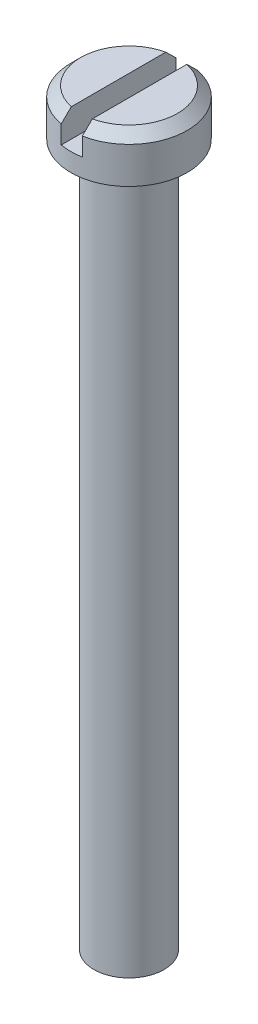
ISO-10303-21;
HEADER;
FILE_DESCRIPTION(('STEP AP214'),'2;1');
FILE_NAME('part.step','',(''),(''),'','','');
FILE_SCHEMA(('AUTOMOTIVE_DESIGN { 1 0 10303 214 1 1 1 1 }'));
ENDSEC;
DATA;
#1=APPLICATION_CONTEXT('core data for automotive mechanical design processes');
#2=APPLICATION_PROTOCOL_DEFINITION('international standard','automotive_design',2000,#1);
#3=PRODUCT_CONTEXT('',#1,'mechanical');
#4=PRODUCT('Part','Part','',(#3));
#5=PRODUCT_RELATED_PRODUCT_CATEGORY('part','',(#4));
#6=PRODUCT_DEFINITION_FORMATION('','',#4);
#7=PRODUCT_DEFINITION_CONTEXT('part definition',#1,'design');
#8=PRODUCT_DEFINITION('design','',#6,#7);
#9=PRODUCT_DEFINITION_SHAPE('','',#8);
#10=(LENGTH_UNIT() NAMED_UNIT(*) SI_UNIT(.MILLI.,.METRE.));
#11=(NAMED_UNIT(*) PLANE_ANGLE_UNIT() SI_UNIT($,.RADIAN.));
#12=(NAMED_UNIT(*) SI_UNIT($,.STERADIAN.) SOLID_ANGLE_UNIT());
#13=UNCERTAINTY_MEASURE_WITH_UNIT(LENGTH_MEASURE(1.E-05),#10,'distance_accuracy_value','');
#14=(GEOMETRIC_REPRESENTATION_CONTEXT(3) GLOBAL_UNCERTAINTY_ASSIGNED_CONTEXT((#13)) GLOBAL_UNIT_ASSIGNED_CONTEXT((#10,
#11,#12)) REPRESENTATION_CONTEXT('',''));
#15=CARTESIAN_POINT('',(0.,0.,0.));
#16=DIRECTION('',(0.,0.,1.));
#17=DIRECTION('',(1.,0.,0.));
#18=AXIS2_PLACEMENT_3D('',#15,#16,#17);
#19=CARTESIAN_POINT('',(0.,53.3,0.));
#20=DIRECTION('',(0.,1.,0.));
#21=DIRECTION('',(0.,0.,1.));
#22=AXIS2_PLACEMENT_3D('',#19,#20,#21);
#23=PLANE('',#22);
#24=CARTESIAN_POINT('',(0.,53.3,0.));
#25=DIRECTION('',(0.,1.,0.));
#26=DIRECTION('',(0.,0.,1.));
#27=AXIS2_PLACEMENT_3D('',#24,#25,#26);
#28=CIRCLE('',#27,3.44999999999998);
#29=CARTESIAN_POINT('',(-0.746487537225198,53.3,-3.36827201347625));
#30=VERTEX_POINT('',#29);
#31=CARTESIAN_POINT('',(-0.746487537225198,53.3,3.36827201347625));
#32=VERTEX_POINT('',#31);
#33=EDGE_CURVE('E130',#30,#32,#28,.T.);
#34=ORIENTED_EDGE('',*,*,#33,.T.);
#35=DIRECTION('',(0.,0.,-1.));
#36=VECTOR('',#35,1.);
#37=CARTESIAN_POINT('',(-0.746487537225198,53.3,0.));
#38=LINE('',#37,#36);
#39=EDGE_CURVE('E114',#32,#30,#38,.T.);
#40=ORIENTED_EDGE('',*,*,#39,.T.);
#41=EDGE_LOOP('',(#34,#40));
#42=FACE_BOUND('',#41,.T.);
#43=ADVANCED_FACE('F34',(#42),#23,.T.);
#44=CARTESIAN_POINT('',(0.753512462774802,53.3,3.36670743731066));
#45=VERTEX_POINT('',#44);
#46=CARTESIAN_POINT('',(0.753512462774802,53.3,-3.36670743731066));
#47=VERTEX_POINT('',#46);
#48=EDGE_CURVE('E131',#45,#47,#28,.T.);
#49=ORIENTED_EDGE('',*,*,#48,.T.);
#50=DIRECTION('',(0.,0.,1.));
#51=VECTOR('',#50,1.);
#52=CARTESIAN_POINT('',(0.753512462774802,53.3,0.));
#53=LINE('',#52,#51);
#54=EDGE_CURVE('E104',#47,#45,#53,.T.);
#55=ORIENTED_EDGE('',*,*,#54,.T.);
#56=EDGE_LOOP('',(#49,#55));
#57=FACE_BOUND('',#56,.T.);
#58=ADVANCED_FACE('F164',(#57),#23,.T.);
#59=CARTESIAN_POINT('',(0.,0.,0.));
#60=DIRECTION('',(0.,-1.,0.));
#61=DIRECTION('',(0.,0.,-1.));
#62=AXIS2_PLACEMENT_3D('',#59,#60,#61);
#63=CYLINDRICAL_SURFACE('',#62,4.15);
#64=CARTESIAN_POINT('',(0.,50.,0.));
#65=DIRECTION('',(0.,-1.,0.));
#66=DIRECTION('',(0.,0.,-1.));
#67=AXIS2_PLACEMENT_3D('',#64,#65,#66);
#68=CIRCLE('',#67,4.15);
#69=CARTESIAN_POINT('',(0.,50.,-4.15));
#70=VERTEX_POINT('',#69);
#71=EDGE_CURVE('E125',#70,#70,#68,.T.);
#72=ORIENTED_EDGE('',*,*,#71,.F.);
#73=EDGE_LOOP('',(#72));
#74=FACE_BOUND('',#73,.T.);
#75=CARTESIAN_POINT('',(0.,52.6,0.));
#76=DIRECTION('',(0.,1.,0.));
#77=DIRECTION('',(0.,0.,1.));
#78=AXIS2_PLACEMENT_3D('',#75,#76,#77);
#79=CIRCLE('',#78,4.15);
#80=CARTESIAN_POINT('',(-0.746487537225198,52.6,4.08231017400288));
#81=VERTEX_POINT('',#80);
#82=CARTESIAN_POINT('',(-0.746487537225198,52.6,-4.08231017400288));
#83=VERTEX_POINT('',#82);
#84=EDGE_CURVE('E128',#81,#83,#79,.F.);
#85=ORIENTED_EDGE('',*,*,#84,.T.);
#86=DIRECTION('',(0.,-1.,0.));
#87=VECTOR('',#86,1.);
#88=CARTESIAN_POINT('',(-0.746487537225191,0.,-4.08231017400288));
#89=LINE('',#88,#87);
#90=CARTESIAN_POINT('',(-0.746487537225198,51.3,-4.08231017400288));
#91=VERTEX_POINT('',#90);
#92=EDGE_CURVE('E111',#83,#91,#89,.T.);
#93=ORIENTED_EDGE('',*,*,#92,.T.);
#94=CARTESIAN_POINT('',(0.,51.3,0.));
#95=DIRECTION('',(0.,1.,0.));
#96=DIRECTION('',(0.,0.,1.));
#97=AXIS2_PLACEMENT_3D('',#94,#95,#96);
#98=CIRCLE('',#97,4.15);
#99=CARTESIAN_POINT('',(0.753512462774802,51.3,-4.08101935408826));
#100=VERTEX_POINT('',#99);
#101=EDGE_CURVE('E11',#91,#100,#98,.F.);
#102=ORIENTED_EDGE('',*,*,#101,.T.);
#103=DIRECTION('',(0.,-1.,0.));
#104=VECTOR('',#103,1.);
#105=CARTESIAN_POINT('',(0.753512462774809,0.,-4.08101935408826));
#106=LINE('',#105,#104);
#107=CARTESIAN_POINT('',(0.753512462774802,52.6,-4.08101935408827));
#108=VERTEX_POINT('',#107);
#109=EDGE_CURVE('E97',#100,#108,#106,.F.);
#110=ORIENTED_EDGE('',*,*,#109,.T.);
#111=CARTESIAN_POINT('',(0.753512462774802,52.6,4.08101935408827));
#112=VERTEX_POINT('',#111);
#113=EDGE_CURVE('E103',#108,#112,#79,.F.);
#114=ORIENTED_EDGE('',*,*,#113,.T.);
#115=DIRECTION('',(0.,-1.,0.));
#116=VECTOR('',#115,1.);
#117=CARTESIAN_POINT('',(0.753512462774809,0.,4.08101935408826));
#118=LINE('',#117,#116);
#119=CARTESIAN_POINT('',(0.753512462774802,51.3,4.08101935408826));
#120=VERTEX_POINT('',#119);
#121=EDGE_CURVE('E50',#112,#120,#118,.T.);
#122=ORIENTED_EDGE('',*,*,#121,.T.);
#123=CARTESIAN_POINT('',(-0.746487537225198,51.3,4.08231017400288));
#124=VERTEX_POINT('',#123);
#125=EDGE_CURVE('E39',#120,#124,#98,.F.);
#126=ORIENTED_EDGE('',*,*,#125,.T.);
#127=DIRECTION('',(0.,-1.,0.));
#128=VECTOR('',#127,1.);
#129=CARTESIAN_POINT('',(-0.746487537225191,0.,4.08231017400288));
#130=LINE('',#129,#128);
#131=EDGE_CURVE('E117',#124,#81,#130,.F.);
#132=ORIENTED_EDGE('',*,*,#131,.T.);
#133=EDGE_LOOP('',(#85,#93,#102,#110,#114,#122,#126,#132));
#134=FACE_BOUND('',#133,.T.);
#135=ADVANCED_FACE('F101',(#74,#134),#63,.T.);
#136=CARTESIAN_POINT('',(0.,52.6,0.));
#137=DIRECTION('',(0.,-1.,0.));
#138=DIRECTION('',(0.,0.,-1.));
#139=AXIS2_PLACEMENT_3D('',#136,#137,#138);
#140=CONICAL_SURFACE('',#139,4.15,0.785398163397449);
#141=ORIENTED_EDGE('',*,*,#84,.F.);
#142=CARTESIAN_POINT('',(-0.746487537225197,47.6021205384899,9.11737105744226));
#143=CARTESIAN_POINT('',(-0.746487537225197,47.9259501673613,8.79244813342562));
#144=CARTESIAN_POINT('',(-0.746487537225197,48.2497311398106,8.46747665907128));
#145=CARTESIAN_POINT('',(-0.746487537225197,48.8971444801022,7.81735377987245));
#146=CARTESIAN_POINT('',(-0.746487537225197,49.2207768398204,7.49220236693819));
#147=CARTESIAN_POINT('',(-0.746487537225197,49.8681946117129,6.84128183078387));
#148=CARTESIAN_POINT('',(-0.746487537225197,50.1919797478256,6.51551243290977));
#149=CARTESIAN_POINT('',(-0.746487537225197,50.8391730303335,5.86363036745787));
#150=CARTESIAN_POINT('',(-0.746487537225198,51.1625811940781,5.53751771710753));
#151=CARTESIAN_POINT('',(-0.746487537225198,51.791240444052,4.90244900563556));
#152=CARTESIAN_POINT('',(-0.746487537225198,52.0965228625702,4.59352399148231));
#153=CARTESIAN_POINT('',(-0.746487537225198,52.5537480198971,4.12940385373759));
#154=CARTESIAN_POINT('',(-0.746487537225198,52.7060510235077,3.97456377271986));
#155=CARTESIAN_POINT('',(-0.746487537225198,53.0103115330643,3.66454856299797));
#156=CARTESIAN_POINT('',(-0.746487537225198,53.1622690436871,3.50937343888528));
#157=CARTESIAN_POINT('',(-0.746487537225198,53.4655767529163,3.19864629961184));
#158=CARTESIAN_POINT('',(-0.746487537225198,53.6169273075328,3.04309463243929));
#159=CARTESIAN_POINT('',(-0.746487537225198,53.9188608079756,2.73123206691568));
#160=CARTESIAN_POINT('',(-0.746487537225198,54.0694437129919,2.57492112904512));
#161=CARTESIAN_POINT('',(-0.746487537225198,54.369303846493,2.26112081288205));
#162=CARTESIAN_POINT('',(-0.746487537225198,54.5185813960515,2.1036317431251));
#163=CARTESIAN_POINT('',(-0.746487537225198,54.7406836047217,1.86571517612606));
#164=CARTESIAN_POINT('',(-0.746487537225198,54.8144122619382,1.786132539215));
#165=CARTESIAN_POINT('',(-0.746487537225198,54.9609825348029,1.62615545374431));
#166=CARTESIAN_POINT('',(-0.746487537225198,55.0338241795858,1.54576103200795));
#167=CARTESIAN_POINT('',(-0.746487537225198,55.1261087577991,1.44217959158602));
#168=CARTESIAN_POINT('',(-0.746487537225198,55.1461765874035,1.4195491561738));
#169=CARTESIAN_POINT('',(-0.746487537225198,55.1861903117341,1.37418041000849));
#170=CARTESIAN_POINT('',(-0.746487537225198,55.2061362053838,1.35144209830631));
#171=CARTESIAN_POINT('',(-0.746487537225198,55.265770176061,1.28304126959772));
#172=CARTESIAN_POINT('',(-0.746487537225198,55.305250695493,1.23719716511608));
#173=CARTESIAN_POINT('',(-0.746487537225198,55.3838333063344,1.14445651376992));
#174=CARTESIAN_POINT('',(-0.746487537225198,55.4229285681307,1.0975541634638));
#175=CARTESIAN_POINT('',(-0.746487537225198,55.5000706813637,1.00291204577719));
#176=CARTESIAN_POINT('',(-0.746487537225198,55.5381178142294,0.955172508933252));
#177=CARTESIAN_POINT('',(-0.746487537225198,55.6130993317743,0.858058440836013));
#178=CARTESIAN_POINT('',(-0.746487537225198,55.650018863784,0.808672362573406));
#179=CARTESIAN_POINT('',(-0.746487537225198,55.7216357299789,0.708192697190229));
#180=CARTESIAN_POINT('',(-0.746487537225198,55.7563300558501,0.657096934945558));
#181=CARTESIAN_POINT('',(-0.746487537225198,55.8218218656264,0.553078863339606));
#182=CARTESIAN_POINT('',(-0.746487537225198,55.8526520451017,0.500177497499572));
#183=CARTESIAN_POINT('',(-0.746487537225198,55.908410977991,0.391409437162884));
#184=CARTESIAN_POINT('',(-0.746487537225198,55.9333579857364,0.335552591462451));
#185=CARTESIAN_POINT('',(-0.746487537225198,55.9688266173884,0.233840944381791));
#186=CARTESIAN_POINT('',(-0.746487537225198,55.9813598987131,0.188716700604369));
#187=CARTESIAN_POINT('',(-0.746487537225198,55.9985592117802,0.0970655323430675));
#188=CARTESIAN_POINT('',(-0.746487537225198,56.0032535088329,0.0505442657961943));
#189=CARTESIAN_POINT('',(-0.746487537225198,56.003751003686,-0.0427355921380241));
#190=CARTESIAN_POINT('',(-0.746487537225198,55.999518540233,-0.0894943881557489));
#191=CARTESIAN_POINT('',(-0.746487537225198,55.983084250358,-0.181651073045574));
#192=CARTESIAN_POINT('',(-0.746487537225198,55.9708564280362,-0.227044015680012));
#193=CARTESIAN_POINT('',(-0.746487537225198,55.9394452775261,-0.319011782146298));
#194=CARTESIAN_POINT('',(-0.746487537225198,55.919815938667,-0.36542735580614));
#195=CARTESIAN_POINT('',(-0.746487537225198,55.8760872649557,-0.456139030814173));
#196=CARTESIAN_POINT('',(-0.746487537225198,55.8519793230264,-0.500430840901226));
#197=CARTESIAN_POINT('',(-0.746487537225198,55.8006327949331,-0.587625896095845));
#198=CARTESIAN_POINT('',(-0.746487537225198,55.7733698596255,-0.630514544939204));
#199=CARTESIAN_POINT('',(-0.746487537225198,55.7168746706314,-0.714900815344579));
#200=CARTESIAN_POINT('',(-0.746487537225198,55.687644247398,-0.75639967749471));
#201=CARTESIAN_POINT('',(-0.746487537225198,55.6249576525302,-0.842269461877671));
#202=CARTESIAN_POINT('',(-0.746487537225198,55.591363726782,-0.88653912804328));
#203=CARTESIAN_POINT('',(-0.746487537225198,55.5230089205063,-0.974171298809458));
#204=CARTESIAN_POINT('',(-0.746487537225198,55.4882478884508,-1.01753368442038));
#205=CARTESIAN_POINT('',(-0.746487537225198,55.3826878364985,-1.14663962630026));
#206=CARTESIAN_POINT('',(-0.746487537225198,55.3106426851019,-1.2313611486868));
#207=CARTESIAN_POINT('',(-0.746487537225198,55.1645605346604,-1.39930813617628));
#208=CARTESIAN_POINT('',(-0.746487537225198,55.0905202815894,-1.48253073511834));
#209=CARTESIAN_POINT('',(-0.746487537225198,54.9412741056374,-1.64788067579237));
#210=CARTESIAN_POINT('',(-0.746487537225198,54.8660685100927,-1.73000831345073));
#211=CARTESIAN_POINT('',(-0.746487537225198,54.7151604140211,-1.89322121575065));
#212=CARTESIAN_POINT('',(-0.746487537225198,54.6394609173987,-1.97430926702415));
#213=CARTESIAN_POINT('',(-0.746487537225198,54.4875074950438,-2.13597426243991));
#214=CARTESIAN_POINT('',(-0.746487537225198,54.4112535310911,-2.21655117061768));
#215=CARTESIAN_POINT('',(-0.746487537225198,54.1820601529801,-2.4575509943065));
#216=CARTESIAN_POINT('',(-0.746487537225198,54.0285311241452,-2.6174125823154));
#217=CARTESIAN_POINT('',(-0.746487537225198,53.6163702646521,-3.04421353800633));
#218=CARTESIAN_POINT('',(-0.746487537225198,53.3569434377248,-3.31038302914938));
#219=CARTESIAN_POINT('',(-0.746487537225198,52.8369214383741,-3.84158424403525));
#220=CARTESIAN_POINT('',(-0.746487537225198,52.5763262453979,-4.10661594760137));
#221=CARTESIAN_POINT('',(-0.746487537225198,52.0543467070807,-4.63615178940799));
#222=CARTESIAN_POINT('',(-0.746487537225198,51.7929620429723,-4.90065561333162));
#223=CARTESIAN_POINT('',(-0.746487537225198,51.2697898882207,-5.4292607792238));
#224=CARTESIAN_POINT('',(-0.746487537225197,51.0080024002993,-5.69336212388804));
#225=CARTESIAN_POINT('',(-0.746487537225197,50.4843707926705,-6.22108821881465));
#226=CARTESIAN_POINT('',(-0.746487537225197,50.2225268869706,-6.48471318145756));
#227=CARTESIAN_POINT('',(-0.746487537225197,49.6986543296175,-7.01178062174234));
#228=CARTESIAN_POINT('',(-0.746487537225197,49.4366256775507,-7.27522309897297));
#229=CARTESIAN_POINT('',(-0.746487537225197,48.91257308311,-7.80183906904338));
#230=CARTESIAN_POINT('',(-0.746487537225197,48.6505492096901,-8.06501263050886));
#231=CARTESIAN_POINT('',(-0.746487537225197,48.1264018348937,-8.59125921502875));
#232=CARTESIAN_POINT('',(-0.746487537225197,47.8642783337682,-8.85433223833314));
#233=CARTESIAN_POINT('',(-0.746487537225197,47.6021205384899,-9.11737105744226));
#234=B_SPLINE_CURVE_WITH_KNOTS('',3,(#142,#143,#144,#145,#146,#147,#148,#149,#150,#151,#152,
#153,#154,#155,#156,#157,#158,#159,#160,#161,#162,#163,#164,#165,#166,#167,#168,#169,#170,#171,
#172,#173,#174,#175,#176,#177,#178,#179,#180,#181,#182,#183,#184,#185,#186,#187,#188,#189,#190,
#191,#192,#193,#194,#195,#196,#197,#198,#199,#200,#201,#202,#203,#204,#205,#206,#207,#208,#209,
#210,#211,#212,#213,#214,#215,#216,#217,#218,#219,#220,#221,#222,#223,#224,#225,#226,#227,#228,
#229,#230,#231,#232,#233),.UNSPECIFIED.,.F.,.F.,(4,2,2,2,2,2,2,2,2,2,2,2,2,2,2,2,2,2,2,2,2,2,2,
2,2,2,2,2,2,2,2,2,2,2,2,2,2,2,2,2,2,2,2,2,2,4),(0.,1.37621399680106,2.7524959250196,
4.13041540212775,5.50826873929535,6.81122097915522,7.46279169464366,8.11435353689048,
8.76545040315975,9.41658152968317,10.067547720791,10.3930034683479,10.7184484970449,
10.8091877957133,10.8999278941964,11.0814254136146,11.2645937685907,11.4477124526829,
11.6326545447603,11.817841612184,12.0013373874184,12.1842560913142,12.3242300870772,
12.4636982750039,12.6037246753836,12.7442086330874,12.8950410145351,13.0461663253151,
13.198547392795,13.3507886013521,13.51747979413,13.684192713099,14.0177718748151,
14.3519326781961,14.6860012611619,15.0187911165996,15.3516041333483,16.0165346205664,
17.1315764238174,18.246637919409,19.362234676197,20.477823927948,21.5925179947249,
22.7072145654831,23.8213292077597,24.935441061569),.UNSPECIFIED.);
#235=EDGE_CURVE('E58',#81,#32,#234,.T.);
#236=ORIENTED_EDGE('',*,*,#235,.T.);
#237=ORIENTED_EDGE('',*,*,#33,.F.);
#238=EDGE_CURVE('E140',#30,#83,#234,.T.);
#239=ORIENTED_EDGE('',*,*,#238,.T.);
#240=EDGE_LOOP('',(#141,#236,#237,#239));
#241=FACE_BOUND('',#240,.T.);
#242=ADVANCED_FACE('F36',(#241),#140,.T.);
#243=ORIENTED_EDGE('',*,*,#113,.F.);
#244=CARTESIAN_POINT('',(0.753512462774803,47.6021205384899,-9.1167931648558));
#245=CARTESIAN_POINT('',(0.753512462774803,47.926238751687,-8.79155984552501));
#246=CARTESIAN_POINT('',(0.753512462774803,48.2503073169071,-8.46627698823895));
#247=CARTESIAN_POINT('',(0.753512462774803,48.8982940285349,-7.81552616260134));
#248=CARTESIAN_POINT('',(0.753512462774803,49.2222121657739,-7.49005818512086));
#249=CARTESIAN_POINT('',(0.753512462774803,49.8700009609614,-6.83869606833688));
#250=CARTESIAN_POINT('',(0.753512462774803,50.193871480266,-6.51280179111034));
#251=CARTESIAN_POINT('',(0.753512462774803,50.8412263869502,-5.86066421715148));
#252=CARTESIAN_POINT('',(0.753512462774802,51.1647107939013,-5.53442093985047));
#253=CARTESIAN_POINT('',(0.753512462774802,51.7931159720505,-4.89948026337751));
#254=CARTESIAN_POINT('',(0.753512462774802,52.0980694318428,-4.59081524917732));
#255=CARTESIAN_POINT('',(0.753512462774802,52.554790083784,-4.12706998672666));
#256=CARTESIAN_POINT('',(0.753512462774802,52.706924174896,-3.97235121414491));
#257=CARTESIAN_POINT('',(0.753512462774802,53.0108404391769,-3.6625727197041));
#258=CARTESIAN_POINT('',(0.753512462774802,53.162622617433,-3.50751300283755));
#259=CARTESIAN_POINT('',(0.753512462774802,53.4656631740809,-3.19691329888899));
#260=CARTESIAN_POINT('',(0.753512462774802,53.6169216052166,-3.04137336333878));
#261=CARTESIAN_POINT('',(0.753512462774802,53.9186563476428,-2.72951965517349));
#262=CARTESIAN_POINT('',(0.753512462774802,54.0691326146739,-2.57320583972412));
#263=CARTESIAN_POINT('',(0.753512462774802,54.3687496980141,-2.25938263020028));
#264=CARTESIAN_POINT('',(0.753512462774802,54.5178908865085,-2.1018735934761));
#265=CARTESIAN_POINT('',(0.753512462774802,54.7397528761258,-1.86389679724089));
#266=CARTESIAN_POINT('',(0.753512462774802,54.8133952651224,-1.78428931945234));
#267=CARTESIAN_POINT('',(0.753512462774802,54.9597757995785,-1.62424845891387));
#268=CARTESIAN_POINT('',(0.753512462774802,55.0325139747692,-1.54381510347896));
#269=CARTESIAN_POINT('',(0.753512462774802,55.1449510893388,-1.41733146710938));
#270=CARTESIAN_POINT('',(0.753512462774802,55.1851237462013,-1.37170271110546));
#271=CARTESIAN_POINT('',(0.753512462774802,55.2648994391159,-1.27994478564539));
#272=CARTESIAN_POINT('',(0.753512462774802,55.3045024468738,-1.23381559153094));
#273=CARTESIAN_POINT('',(0.753512462774802,55.3829104352745,-1.14095222258888));
#274=CARTESIAN_POINT('',(0.753512462774802,55.4217160949251,-1.09421862285877));
#275=CARTESIAN_POINT('',(0.753512462774802,55.498273984234,-0.999898629593826));
#276=CARTESIAN_POINT('',(0.753512462774802,55.5360263009868,-0.952312307102948));
#277=CARTESIAN_POINT('',(0.753512462774802,55.6105981540506,-0.855242021231461));
#278=CARTESIAN_POINT('',(0.753512462774802,55.6473945539481,-0.805740157636488));
#279=CARTESIAN_POINT('',(0.753512462774802,55.7187249719406,-0.704995348296947));
#280=CARTESIAN_POINT('',(0.753512462774802,55.7532554541014,-0.653749862372676));
#281=CARTESIAN_POINT('',(0.753512462774802,55.81833442089,-0.549429879639196));
#282=CARTESIAN_POINT('',(0.753512462774802,55.8489178151198,-0.496377549629345));
#283=CARTESIAN_POINT('',(0.753512462774802,55.9040813658345,-0.38730099492662));
#284=CARTESIAN_POINT('',(0.753512462774802,55.9286806506167,-0.331286955442998));
#285=CARTESIAN_POINT('',(0.753512462774802,55.9634966864486,-0.229192670834425));
#286=CARTESIAN_POINT('',(0.753512462774802,55.9757270950428,-0.183827797534023));
#287=CARTESIAN_POINT('',(0.753512462774802,55.99225996217,-0.0917437335910525));
#288=CARTESIAN_POINT('',(0.753512462774802,55.9965895265073,-0.0450297340383229));
#289=CARTESIAN_POINT('',(0.753512462774802,55.9963814815119,0.0485340072015442));
#290=CARTESIAN_POINT('',(0.753512462774802,55.9918140456166,0.0953836779205803));
#291=CARTESIAN_POINT('',(0.753512462774802,55.9748054884422,0.187691693406028));
#292=CARTESIAN_POINT('',(0.753512462774802,55.9623388947836,0.23314503639586));
#293=CARTESIAN_POINT('',(0.753512462774802,55.9301707281557,0.326246682200779));
#294=CARTESIAN_POINT('',(0.753512462774802,55.909888614123,0.373685620311169));
#295=CARTESIAN_POINT('',(0.753512462774802,55.8647615588389,0.466378608825537));
#296=CARTESIAN_POINT('',(0.753512462774802,55.8399076096663,0.511628119089587));
#297=CARTESIAN_POINT('',(0.753512462774802,55.7870170369568,0.600706003546247));
#298=CARTESIAN_POINT('',(0.753512462774802,55.7589556242632,0.644519398237316));
#299=CARTESIAN_POINT('',(0.753512462774802,55.7008412886009,0.730727680667605));
#300=CARTESIAN_POINT('',(0.753512462774802,55.6707902676947,0.77312386651938));
#301=CARTESIAN_POINT('',(0.753512462774802,55.6062862134075,0.860973019837943));
#302=CARTESIAN_POINT('',(0.753512462774802,55.5716899136284,0.906320077221132));
#303=CARTESIAN_POINT('',(0.753512462774802,55.5013169272251,0.996091988510584));
#304=CARTESIAN_POINT('',(0.753512462774802,55.4655400896852,1.04051672331856));
#305=CARTESIAN_POINT('',(0.753512462774802,55.3569208844888,1.17279603945814));
#306=CARTESIAN_POINT('',(0.753512462774802,55.2828209266025,1.2596147740394));
#307=CARTESIAN_POINT('',(0.753512462774802,55.1326162595106,1.43174241529533));
#308=CARTESIAN_POINT('',(0.753512462774802,55.0565083269072,1.51704847396323));
#309=CARTESIAN_POINT('',(0.753512462774802,54.903121867983,1.68655796765832));
#310=CARTESIAN_POINT('',(0.753512462774802,54.8258436639664,1.77076169478154));
#311=CARTESIAN_POINT('',(0.753512462774802,54.6708118643614,1.93809835743273));
#312=CARTESIAN_POINT('',(0.753512462774802,54.5930614404164,2.02123424097344));
#313=CARTESIAN_POINT('',(0.753512462774802,54.437005291082,2.186993331099));
#314=CARTESIAN_POINT('',(0.753512462774802,54.3586995281013,2.26961650225446));
#315=CARTESIAN_POINT('',(0.753512462774802,54.1233511981205,2.51675398858921));
#316=CARTESIAN_POINT('',(0.753512462774802,53.9657189097738,2.68070612913364));
#317=CARTESIAN_POINT('',(0.753512462774802,53.5521995717596,3.10849519861971));
#318=CARTESIAN_POINT('',(0.753512462774802,53.2956045655115,3.37164591723246));
#319=CARTESIAN_POINT('',(0.753512462774802,52.7813006692465,3.89686230442344));
#320=CARTESIAN_POINT('',(0.753512462774802,52.5235917611029,4.15892795520721));
#321=CARTESIAN_POINT('',(0.753512462774802,52.0074142363314,4.68254982231812));
#322=CARTESIAN_POINT('',(0.753512462774802,51.7489453224403,4.9441057454958));
#323=CARTESIAN_POINT('',(0.753512462774802,51.2316148337865,5.46682555294113));
#324=CARTESIAN_POINT('',(0.753512462774803,50.9727532614495,5.72798943961094));
#325=CARTESIAN_POINT('',(0.753512462774803,50.4547421180166,6.25008401509021));
#326=CARTESIAN_POINT('',(0.753512462774803,50.1955925203484,6.51101467753055));
#327=CARTESIAN_POINT('',(0.753512462774803,49.6771108335635,7.03269566174721));
#328=CARTESIAN_POINT('',(0.753512462774803,49.417778744073,7.29344598315201));
#329=CARTESIAN_POINT('',(0.753512462774803,48.8991142369511,7.81468476227124));
#330=CARTESIAN_POINT('',(0.753512462774803,48.639781885383,8.07517328573014));
#331=CARTESIAN_POINT('',(0.753512462774803,48.1210179768903,8.59605033837017));
#332=CARTESIAN_POINT('',(0.753512462774803,47.8615864201956,8.85643886778033));
#333=CARTESIAN_POINT('',(0.753512462774803,47.6021205384899,9.1167931648558));
#334=B_SPLINE_CURVE_WITH_KNOTS('',3,(#244,#245,#246,#247,#248,#249,#250,#251,#252,#253,#254,
#255,#256,#257,#258,#259,#260,#261,#262,#263,#264,#265,#266,#267,#268,#269,#270,#271,#272,#273,
#274,#275,#276,#277,#278,#279,#280,#281,#282,#283,#284,#285,#286,#287,#288,#289,#290,#291,#292,
#293,#294,#295,#296,#297,#298,#299,#300,#301,#302,#303,#304,#305,#306,#307,#308,#309,#310,#311,
#312,#313,#314,#315,#316,#317,#318,#319,#320,#321,#322,#323,#324,#325,#326,#327,#328,#329,#330,
#331,#332,#333),.UNSPECIFIED.,.F.,.F.,(4,2,2,2,2,2,2,2,2,2,2,2,2,2,2,2,2,2,2,2,2,2,2,2,2,2,2,2,
2,2,2,2,2,2,2,2,2,2,2,2,2,2,2,2,4),(0.,1.3774847038476,2.75504454079978,4.13341030040354,
5.51170294256423,6.81340665749533,7.46436257117355,8.11530901543562,8.76618787994523,
9.41710318264689,10.0678309921998,10.3931652925893,10.7184888673361,10.9008653519732,
11.083250864107,11.2654740197604,11.447682063572,11.6326802837978,11.8179606440165,
12.0014698594921,12.1843845411764,12.324804841279,12.4647424824847,12.6051500621742,
12.7460127340113,12.9004236979023,13.0551422226021,13.2111496681575,13.3670100662476,
13.5380942604961,13.7092004109164,14.0515668758473,14.394521123947,14.7373825775313,
15.0788620660149,15.4203648943259,16.1026732609932,17.205301065747,18.3079468818675,
19.4111048385818,20.5142560079884,21.6175191818012,22.7207846216697,23.8234939164046,
24.9262006702834),.UNSPECIFIED.);
#335=EDGE_CURVE('E139',#108,#47,#334,.T.);
#336=ORIENTED_EDGE('',*,*,#335,.T.);
#337=ORIENTED_EDGE('',*,*,#48,.F.);
#338=EDGE_CURVE('E134',#45,#112,#334,.T.);
#339=ORIENTED_EDGE('',*,*,#338,.T.);
#340=EDGE_LOOP('',(#243,#336,#337,#339));
#341=FACE_BOUND('',#340,.T.);
#342=ADVANCED_FACE('F169',(#341),#140,.T.);
#343=CARTESIAN_POINT('',(0.,0.,0.));
#344=DIRECTION('',(0.,-1.,0.));
#345=DIRECTION('',(0.,0.,-1.));
#346=AXIS2_PLACEMENT_3D('',#343,#344,#345);
#347=PLANE('',#346);
#348=CARTESIAN_POINT('',(0.,0.,0.));
#349=DIRECTION('',(0.,-1.,0.));
#350=DIRECTION('',(0.,0.,-1.));
#351=AXIS2_PLACEMENT_3D('',#348,#349,#350);
#352=CIRCLE('',#351,2.5);
#353=CARTESIAN_POINT('',(0.,0.,-2.5));
#354=VERTEX_POINT('',#353);
#355=EDGE_CURVE('E119',#354,#354,#352,.T.);
#356=ORIENTED_EDGE('',*,*,#355,.T.);
#357=EDGE_LOOP('',(#356));
#358=FACE_BOUND('',#357,.T.);
#359=ADVANCED_FACE('F160',(#358),#347,.T.);
#360=CARTESIAN_POINT('',(2.5,50.,0.));
#361=DIRECTION('',(0.,-1.,0.));
#362=DIRECTION('',(0.,0.,-1.));
#363=AXIS2_PLACEMENT_3D('',#360,#361,#362);
#364=PLANE('',#363);
#365=ORIENTED_EDGE('',*,*,#71,.T.);
#366=EDGE_LOOP('',(#365));
#367=FACE_BOUND('',#366,.T.);
#368=CARTESIAN_POINT('',(0.,50.,0.));
#369=DIRECTION('',(0.,-1.,0.));
#370=DIRECTION('',(0.,0.,-1.));
#371=AXIS2_PLACEMENT_3D('',#368,#369,#370);
#372=CIRCLE('',#371,2.5);
#373=CARTESIAN_POINT('',(0.,50.,-2.5));
#374=VERTEX_POINT('',#373);
#375=EDGE_CURVE('E122',#374,#374,#372,.T.);
#376=ORIENTED_EDGE('',*,*,#375,.F.);
#377=EDGE_LOOP('',(#376));
#378=FACE_BOUND('',#377,.T.);
#379=ADVANCED_FACE('F156',(#367,#378),#364,.T.);
#380=CARTESIAN_POINT('',(0.,0.,0.));
#381=DIRECTION('',(0.,-1.,0.));
#382=DIRECTION('',(0.,0.,-1.));
#383=AXIS2_PLACEMENT_3D('',#380,#381,#382);
#384=CYLINDRICAL_SURFACE('',#383,2.5);
#385=ORIENTED_EDGE('',*,*,#375,.T.);
#386=EDGE_LOOP('',(#385));
#387=FACE_BOUND('',#386,.T.);
#388=ORIENTED_EDGE('',*,*,#355,.F.);
#389=EDGE_LOOP('',(#388));
#390=FACE_BOUND('',#389,.T.);
#391=ADVANCED_FACE('F153',(#387,#390),#384,.T.);
#392=CARTESIAN_POINT('',(-0.746487537225198,58.0872107996468,50.));
#393=DIRECTION('',(1.,0.,0.));
#394=DIRECTION('',(0.,1.,0.));
#395=AXIS2_PLACEMENT_3D('',#392,#393,#394);
#396=PLANE('',#395);
#397=DIRECTION('',(0.,0.,-1.));
#398=VECTOR('',#397,1.);
#399=CARTESIAN_POINT('',(-0.746487537225198,51.3,50.));
#400=LINE('',#399,#398);
#401=EDGE_CURVE('E93',#124,#91,#400,.T.);
#402=ORIENTED_EDGE('',*,*,#401,.T.);
#403=ORIENTED_EDGE('',*,*,#92,.F.);
#404=ORIENTED_EDGE('',*,*,#238,.F.);
#405=ORIENTED_EDGE('',*,*,#39,.F.);
#406=ORIENTED_EDGE('',*,*,#235,.F.);
#407=ORIENTED_EDGE('',*,*,#131,.F.);
#408=EDGE_LOOP('',(#402,#403,#404,#405,#406,#407));
#409=FACE_BOUND('',#408,.T.);
#410=ADVANCED_FACE('F149',(#409),#396,.T.);
#411=CARTESIAN_POINT('',(0.753512462774802,51.3,50.));
#412=DIRECTION('',(0.,1.,0.));
#413=DIRECTION('',(0.,0.,1.));
#414=AXIS2_PLACEMENT_3D('',#411,#412,#413);
#415=PLANE('',#414);
#416=ORIENTED_EDGE('',*,*,#401,.F.);
#417=ORIENTED_EDGE('',*,*,#125,.F.);
#418=DIRECTION('',(0.,0.,-1.));
#419=VECTOR('',#418,1.);
#420=CARTESIAN_POINT('',(0.753512462774802,51.3,50.));
#421=LINE('',#420,#419);
#422=EDGE_CURVE('E91',#120,#100,#421,.T.);
#423=ORIENTED_EDGE('',*,*,#422,.T.);
#424=ORIENTED_EDGE('',*,*,#101,.F.);
#425=EDGE_LOOP('',(#416,#417,#423,#424));
#426=FACE_BOUND('',#425,.T.);
#427=ADVANCED_FACE('F90',(#426),#415,.T.);
#428=CARTESIAN_POINT('',(0.753512462774802,58.0872107996468,50.));
#429=DIRECTION('',(-1.,0.,0.));
#430=DIRECTION('',(0.,-1.,0.));
#431=AXIS2_PLACEMENT_3D('',#428,#429,#430);
#432=PLANE('',#431);
#433=ORIENTED_EDGE('',*,*,#422,.F.);
#434=ORIENTED_EDGE('',*,*,#121,.F.);
#435=ORIENTED_EDGE('',*,*,#338,.F.);
#436=ORIENTED_EDGE('',*,*,#54,.F.);
#437=ORIENTED_EDGE('',*,*,#335,.F.);
#438=ORIENTED_EDGE('',*,*,#109,.F.);
#439=EDGE_LOOP('',(#433,#434,#435,#436,#437,#438));
#440=FACE_BOUND('',#439,.T.);
#441=ADVANCED_FACE('F95',(#440),#432,.T.);
#442=CLOSED_SHELL('',(#43,#58,#135,#242,#342,#359,#379,#391,#410,#427,#441));
#443=MANIFOLD_SOLID_BREP('B2',#442);
#444=ADVANCED_BREP_SHAPE_REPRESENTATION('',(#18,#443),#14);
#445=SHAPE_DEFINITION_REPRESENTATION(#9,#444);
ENDSEC;
END-ISO-10303-21;
